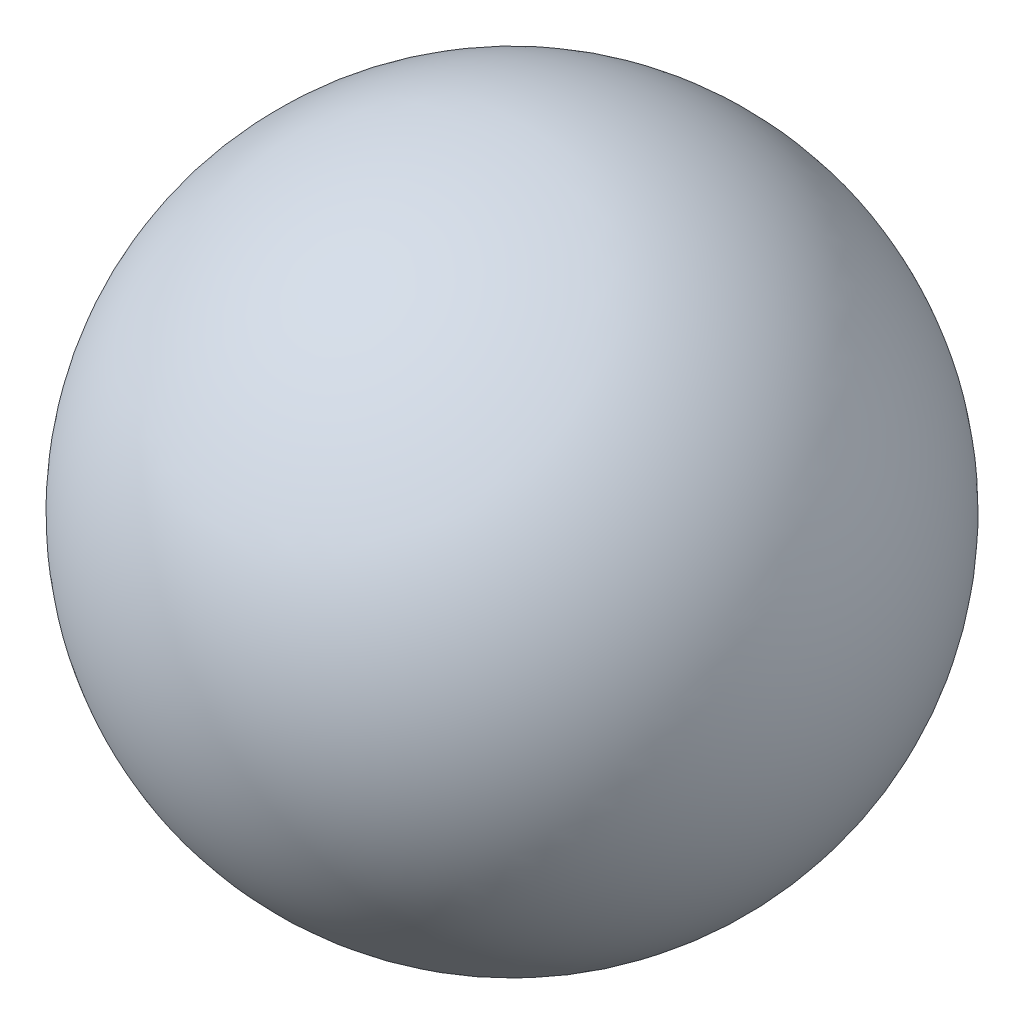
ISO-10303-21;
HEADER;
FILE_DESCRIPTION(('STEP AP214'),'2;1');
FILE_NAME('part.step','',(''),(''),'','','');
FILE_SCHEMA(('AUTOMOTIVE_DESIGN { 1 0 10303 214 1 1 1 1 }'));
ENDSEC;
DATA;
#1=APPLICATION_CONTEXT('core data for automotive mechanical design processes');
#2=APPLICATION_PROTOCOL_DEFINITION('international standard','automotive_design',2000,#1);
#3=PRODUCT_CONTEXT('',#1,'mechanical');
#4=PRODUCT('Part','Part','',(#3));
#5=PRODUCT_RELATED_PRODUCT_CATEGORY('part','',(#4));
#6=PRODUCT_DEFINITION_FORMATION('','',#4);
#7=PRODUCT_DEFINITION_CONTEXT('part definition',#1,'design');
#8=PRODUCT_DEFINITION('design','',#6,#7);
#9=PRODUCT_DEFINITION_SHAPE('','',#8);
#10=(LENGTH_UNIT() NAMED_UNIT(*) SI_UNIT(.MILLI.,.METRE.));
#11=(NAMED_UNIT(*) PLANE_ANGLE_UNIT() SI_UNIT($,.RADIAN.));
#12=(NAMED_UNIT(*) SI_UNIT($,.STERADIAN.) SOLID_ANGLE_UNIT());
#13=UNCERTAINTY_MEASURE_WITH_UNIT(LENGTH_MEASURE(1.E-05),#10,'distance_accuracy_value','');
#14=(GEOMETRIC_REPRESENTATION_CONTEXT(3) GLOBAL_UNCERTAINTY_ASSIGNED_CONTEXT((#13)) GLOBAL_UNIT_ASSIGNED_CONTEXT((#10,
#11,#12)) REPRESENTATION_CONTEXT('',''));
#15=CARTESIAN_POINT('',(0.,0.,0.));
#16=DIRECTION('',(0.,0.,1.));
#17=DIRECTION('',(1.,0.,0.));
#18=AXIS2_PLACEMENT_3D('',#15,#16,#17);
#19=CARTESIAN_POINT('',(4.36703385400882,-2.,10.9083232129389));
#20=DIRECTION('',(0.,0.,1.));
#21=DIRECTION('',(1.,0.,0.));
#22=AXIS2_PLACEMENT_3D('',#19,#20,#21);
#23=SPHERICAL_SURFACE('',#22,1.05);
#24=CARTESIAN_POINT('',(4.36703385400882,-2.,11.9583232129389));
#25=VERTEX_POINT('',#24);
#26=VERTEX_LOOP('',#25);
#27=FACE_BOUND('',#26,.T.);
#28=ADVANCED_FACE('F12',(#27),#23,.T.);
#29=CLOSED_SHELL('',(#28));
#30=MANIFOLD_SOLID_BREP('B1',#29);
#31=ADVANCED_BREP_SHAPE_REPRESENTATION('',(#18,#30),#14);
#32=SHAPE_DEFINITION_REPRESENTATION(#9,#31);
ENDSEC;
END-ISO-10303-21;
